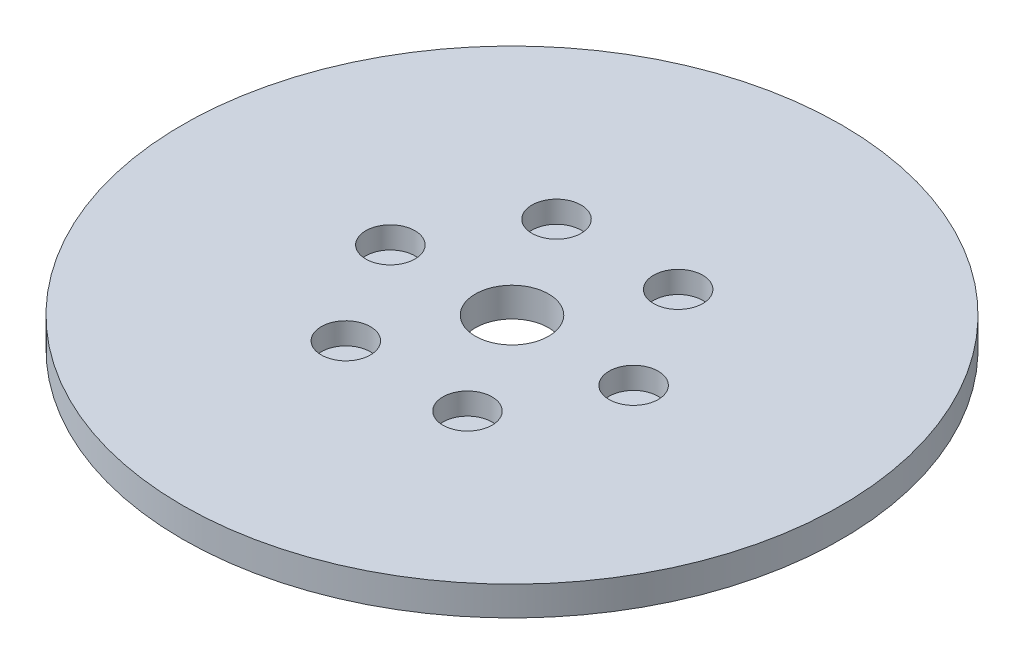
ISO-10303-21;
HEADER;
FILE_DESCRIPTION(('STEP AP214'),'2;1');
FILE_NAME('part.step','',(''),(''),'','','');
FILE_SCHEMA(('AUTOMOTIVE_DESIGN { 1 0 10303 214 1 1 1 1 }'));
ENDSEC;
DATA;
#1=APPLICATION_CONTEXT('core data for automotive mechanical design processes');
#2=APPLICATION_PROTOCOL_DEFINITION('international standard','automotive_design',2000,#1);
#3=PRODUCT_CONTEXT('',#1,'mechanical');
#4=PRODUCT('Part','Part','',(#3));
#5=PRODUCT_RELATED_PRODUCT_CATEGORY('part','',(#4));
#6=PRODUCT_DEFINITION_FORMATION('','',#4);
#7=PRODUCT_DEFINITION_CONTEXT('part definition',#1,'design');
#8=PRODUCT_DEFINITION('design','',#6,#7);
#9=PRODUCT_DEFINITION_SHAPE('','',#8);
#10=(LENGTH_UNIT() NAMED_UNIT(*) SI_UNIT(.MILLI.,.METRE.));
#11=(NAMED_UNIT(*) PLANE_ANGLE_UNIT() SI_UNIT($,.RADIAN.));
#12=(NAMED_UNIT(*) SI_UNIT($,.STERADIAN.) SOLID_ANGLE_UNIT());
#13=UNCERTAINTY_MEASURE_WITH_UNIT(LENGTH_MEASURE(1.E-05),#10,'distance_accuracy_value','');
#14=(GEOMETRIC_REPRESENTATION_CONTEXT(3) GLOBAL_UNCERTAINTY_ASSIGNED_CONTEXT((#13)) GLOBAL_UNIT_ASSIGNED_CONTEXT((#10,
#11,#12)) REPRESENTATION_CONTEXT('',''));
#15=CARTESIAN_POINT('',(0.,0.,0.));
#16=DIRECTION('',(0.,0.,1.));
#17=DIRECTION('',(1.,0.,0.));
#18=AXIS2_PLACEMENT_3D('',#15,#16,#17);
#19=CARTESIAN_POINT('',(0.,8.,0.));
#20=DIRECTION('',(0.,-1.,0.));
#21=DIRECTION('',(0.,0.,-1.));
#22=AXIS2_PLACEMENT_3D('',#19,#20,#21);
#23=CYLINDRICAL_SURFACE('',#22,90.);
#24=CARTESIAN_POINT('',(0.,8.,0.));
#25=DIRECTION('',(0.,1.,0.));
#26=DIRECTION('',(0.,0.,1.));
#27=AXIS2_PLACEMENT_3D('',#24,#25,#26);
#28=CIRCLE('',#27,90.);
#29=CARTESIAN_POINT('',(0.,8.,90.));
#30=VERTEX_POINT('',#29);
#31=EDGE_CURVE('E10',#30,#30,#28,.T.);
#32=ORIENTED_EDGE('',*,*,#31,.F.);
#33=EDGE_LOOP('',(#32));
#34=FACE_BOUND('',#33,.T.);
#35=CARTESIAN_POINT('',(0.,0.,0.));
#36=DIRECTION('',(0.,1.,0.));
#37=DIRECTION('',(0.,0.,1.));
#38=AXIS2_PLACEMENT_3D('',#35,#36,#37);
#39=CIRCLE('',#38,90.);
#40=CARTESIAN_POINT('',(0.,0.,90.));
#41=VERTEX_POINT('',#40);
#42=EDGE_CURVE('E37',#41,#41,#39,.T.);
#43=ORIENTED_EDGE('',*,*,#42,.T.);
#44=EDGE_LOOP('',(#43));
#45=FACE_BOUND('',#44,.T.);
#46=ADVANCED_FACE('F40',(#34,#45),#23,.T.);
#47=CARTESIAN_POINT('',(0.,8.,0.));
#48=DIRECTION('',(0.,1.,0.));
#49=DIRECTION('',(0.,0.,1.));
#50=AXIS2_PLACEMENT_3D('',#47,#48,#49);
#51=PLANE('',#50);
#52=CARTESIAN_POINT('',(-16.608898167708,8.,-28.7674554842071));
#53=DIRECTION('',(0.,1.,0.));
#54=DIRECTION('',(-0.866025403784433,0.,0.50000000000001));
#55=AXIS2_PLACEMENT_3D('',#52,#53,#54);
#56=CIRCLE('',#55,6.7142746204076);
#57=CARTESIAN_POINT('',(-22.423630556966,8.,-25.4103181740032));
#58=VERTEX_POINT('',#57);
#59=EDGE_CURVE('E70',#58,#58,#56,.T.);
#60=ORIENTED_EDGE('',*,*,#59,.F.);
#61=EDGE_LOOP('',(#60));
#62=FACE_BOUND('',#61,.T.);
#63=CARTESIAN_POINT('',(16.6088981677074,8.,-28.7674554842074));
#64=DIRECTION('',(0.,1.,0.));
#65=DIRECTION('',(-0.866025403784443,0.,-0.499999999999992));
#66=AXIS2_PLACEMENT_3D('',#63,#64,#65);
#67=CIRCLE('',#66,6.7142746204076);
#68=CARTESIAN_POINT('',(10.7941657784492,8.,-32.1245927944112));
#69=VERTEX_POINT('',#68);
#70=EDGE_CURVE('E71',#69,#69,#67,.T.);
#71=ORIENTED_EDGE('',*,*,#70,.F.);
#72=EDGE_LOOP('',(#71));
#73=FACE_BOUND('',#72,.T.);
#74=CARTESIAN_POINT('',(33.2177963354153,8.,0.));
#75=DIRECTION('',(0.,1.,0.));
#76=DIRECTION('',(0.,0.,-1.));
#77=AXIS2_PLACEMENT_3D('',#74,#75,#76);
#78=CIRCLE('',#77,6.7142746204076);
#79=CARTESIAN_POINT('',(33.2177963354153,8.,-6.7142746204076));
#80=VERTEX_POINT('',#79);
#81=EDGE_CURVE('E78',#80,#80,#78,.T.);
#82=ORIENTED_EDGE('',*,*,#81,.F.);
#83=EDGE_LOOP('',(#82));
#84=FACE_BOUND('',#83,.T.);
#85=CARTESIAN_POINT('',(16.6088981677078,8.,28.7674554842072));
#86=DIRECTION('',(0.,1.,0.));
#87=DIRECTION('',(0.866025403784436,0.,-0.500000000000004));
#88=AXIS2_PLACEMENT_3D('',#85,#86,#87);
#89=CIRCLE('',#88,6.7142746204076);
#90=CARTESIAN_POINT('',(22.4236305569659,8.,25.4103181740034));
#91=VERTEX_POINT('',#90);
#92=EDGE_CURVE('E84',#91,#91,#89,.T.);
#93=ORIENTED_EDGE('',*,*,#92,.F.);
#94=EDGE_LOOP('',(#93));
#95=FACE_BOUND('',#94,.T.);
#96=CARTESIAN_POINT('',(-16.6088981677076,8.,28.7674554842073));
#97=DIRECTION('',(0.,1.,0.));
#98=DIRECTION('',(0.86602540378444,0.,0.499999999999998));
#99=AXIS2_PLACEMENT_3D('',#96,#97,#98);
#100=CIRCLE('',#99,6.7142746204076);
#101=CARTESIAN_POINT('',(-10.7941657784495,8.,32.1245927944111));
#102=VERTEX_POINT('',#101);
#103=EDGE_CURVE('E61',#102,#102,#100,.T.);
#104=ORIENTED_EDGE('',*,*,#103,.F.);
#105=EDGE_LOOP('',(#104));
#106=FACE_BOUND('',#105,.T.);
#107=CARTESIAN_POINT('',(-33.2177963354153,8.,0.));
#108=DIRECTION('',(0.,1.,0.));
#109=DIRECTION('',(0.,0.,1.));
#110=AXIS2_PLACEMENT_3D('',#107,#108,#109);
#111=CIRCLE('',#110,6.7142746204076);
#112=CARTESIAN_POINT('',(-33.2177963354153,8.,6.7142746204076));
#113=VERTEX_POINT('',#112);
#114=EDGE_CURVE('E54',#113,#113,#111,.T.);
#115=ORIENTED_EDGE('',*,*,#114,.F.);
#116=EDGE_LOOP('',(#115));
#117=FACE_BOUND('',#116,.T.);
#118=CARTESIAN_POINT('',(0.,8.,0.));
#119=DIRECTION('',(0.,1.,0.));
#120=DIRECTION('',(0.,0.,1.));
#121=AXIS2_PLACEMENT_3D('',#118,#119,#120);
#122=CIRCLE('',#121,10.);
#123=CARTESIAN_POINT('',(0.,8.,10.));
#124=VERTEX_POINT('',#123);
#125=EDGE_CURVE('E50',#124,#124,#122,.T.);
#126=ORIENTED_EDGE('',*,*,#125,.F.);
#127=EDGE_LOOP('',(#126));
#128=FACE_BOUND('',#127,.T.);
#129=ORIENTED_EDGE('',*,*,#31,.T.);
#130=EDGE_LOOP('',(#129));
#131=FACE_BOUND('',#130,.T.);
#132=ADVANCED_FACE('F99',(#62,#73,#84,#95,#106,#117,#128,#131),#51,.T.);
#133=CARTESIAN_POINT('',(0.,0.,0.));
#134=DIRECTION('',(0.,1.,0.));
#135=DIRECTION('',(0.,0.,1.));
#136=AXIS2_PLACEMENT_3D('',#133,#134,#135);
#137=PLANE('',#136);
#138=CARTESIAN_POINT('',(0.,0.,0.));
#139=DIRECTION('',(0.,1.,0.));
#140=DIRECTION('',(0.,0.,1.));
#141=AXIS2_PLACEMENT_3D('',#138,#139,#140);
#142=CIRCLE('',#141,10.);
#143=CARTESIAN_POINT('',(0.,0.,10.));
#144=VERTEX_POINT('',#143);
#145=EDGE_CURVE('E47',#144,#144,#142,.T.);
#146=ORIENTED_EDGE('',*,*,#145,.T.);
#147=EDGE_LOOP('',(#146));
#148=FACE_BOUND('',#147,.T.);
#149=ORIENTED_EDGE('',*,*,#42,.F.);
#150=EDGE_LOOP('',(#149));
#151=FACE_BOUND('',#150,.T.);
#152=ADVANCED_FACE('F103',(#148,#151),#137,.F.);
#153=CARTESIAN_POINT('',(0.,8.,0.));
#154=DIRECTION('',(0.,-1.,0.));
#155=DIRECTION('',(0.,0.,-1.));
#156=AXIS2_PLACEMENT_3D('',#153,#154,#155);
#157=CYLINDRICAL_SURFACE('',#156,10.);
#158=ORIENTED_EDGE('',*,*,#125,.T.);
#159=EDGE_LOOP('',(#158));
#160=FACE_BOUND('',#159,.T.);
#161=ORIENTED_EDGE('',*,*,#145,.F.);
#162=EDGE_LOOP('',(#161));
#163=FACE_BOUND('',#162,.T.);
#164=ADVANCED_FACE('F115',(#160,#163),#157,.F.);
#165=CARTESIAN_POINT('',(-33.2177963354153,2.04279905783907,0.));
#166=DIRECTION('',(0.,1.,0.));
#167=DIRECTION('',(0.,0.,1.));
#168=AXIS2_PLACEMENT_3D('',#165,#166,#167);
#169=CYLINDRICAL_SURFACE('',#168,6.7142746204076);
#170=CARTESIAN_POINT('',(-33.2177963354153,2.04279905783907,0.));
#171=DIRECTION('',(0.,1.,0.));
#172=DIRECTION('',(0.,0.,1.));
#173=AXIS2_PLACEMENT_3D('',#170,#171,#172);
#174=CIRCLE('',#173,6.7142746204076);
#175=CARTESIAN_POINT('',(-33.2177963354153,2.04279905783907,6.7142746204076));
#176=VERTEX_POINT('',#175);
#177=EDGE_CURVE('E55',#176,#176,#174,.T.);
#178=ORIENTED_EDGE('',*,*,#177,.F.);
#179=EDGE_LOOP('',(#178));
#180=FACE_BOUND('',#179,.T.);
#181=ORIENTED_EDGE('',*,*,#114,.T.);
#182=EDGE_LOOP('',(#181));
#183=FACE_BOUND('',#182,.T.);
#184=ADVANCED_FACE('F113',(#180,#183),#169,.F.);
#185=CARTESIAN_POINT('',(-33.2177963354153,2.04279905783907,0.));
#186=DIRECTION('',(0.,1.,0.));
#187=DIRECTION('',(0.,0.,1.));
#188=AXIS2_PLACEMENT_3D('',#185,#186,#187);
#189=PLANE('',#188);
#190=ORIENTED_EDGE('',*,*,#177,.T.);
#191=EDGE_LOOP('',(#190));
#192=FACE_BOUND('',#191,.T.);
#193=ADVANCED_FACE('F144',(#192),#189,.T.);
#194=CARTESIAN_POINT('',(-16.6088981677076,2.04279905783907,28.7674554842073));
#195=DIRECTION('',(0.,1.,0.));
#196=DIRECTION('',(0.,0.,1.));
#197=AXIS2_PLACEMENT_3D('',#194,#195,#196);
#198=CYLINDRICAL_SURFACE('',#197,6.7142746204076);
#199=CARTESIAN_POINT('',(-16.6088981677076,2.04279905783907,28.7674554842073));
#200=DIRECTION('',(0.,1.,0.));
#201=DIRECTION('',(0.86602540378444,0.,0.499999999999998));
#202=AXIS2_PLACEMENT_3D('',#199,#200,#201);
#203=CIRCLE('',#202,6.7142746204076);
#204=CARTESIAN_POINT('',(-10.7941657784495,2.04279905783907,32.1245927944111));
#205=VERTEX_POINT('',#204);
#206=EDGE_CURVE('E59',#205,#205,#203,.T.);
#207=ORIENTED_EDGE('',*,*,#206,.F.);
#208=EDGE_LOOP('',(#207));
#209=FACE_BOUND('',#208,.T.);
#210=ORIENTED_EDGE('',*,*,#103,.T.);
#211=EDGE_LOOP('',(#210));
#212=FACE_BOUND('',#211,.T.);
#213=ADVANCED_FACE('F153',(#209,#212),#198,.F.);
#214=CARTESIAN_POINT('',(-16.6088981677076,2.04279905783907,28.7674554842073));
#215=DIRECTION('',(0.,1.,0.));
#216=DIRECTION('',(0.86602540378444,0.,0.499999999999998));
#217=AXIS2_PLACEMENT_3D('',#214,#215,#216);
#218=PLANE('',#217);
#219=ORIENTED_EDGE('',*,*,#206,.T.);
#220=EDGE_LOOP('',(#219));
#221=FACE_BOUND('',#220,.T.);
#222=ADVANCED_FACE('F96',(#221),#218,.T.);
#223=CARTESIAN_POINT('',(16.6088981677078,2.04279905783907,28.7674554842072));
#224=DIRECTION('',(0.,1.,0.));
#225=DIRECTION('',(0.,0.,1.));
#226=AXIS2_PLACEMENT_3D('',#223,#224,#225);
#227=CYLINDRICAL_SURFACE('',#226,6.7142746204076);
#228=CARTESIAN_POINT('',(16.6088981677078,2.04279905783907,28.7674554842072));
#229=DIRECTION('',(0.,1.,0.));
#230=DIRECTION('',(0.866025403784436,0.,-0.500000000000004));
#231=AXIS2_PLACEMENT_3D('',#228,#229,#230);
#232=CIRCLE('',#231,6.7142746204076);
#233=CARTESIAN_POINT('',(22.4236305569659,2.04279905783907,25.4103181740034));
#234=VERTEX_POINT('',#233);
#235=EDGE_CURVE('E63',#234,#234,#232,.T.);
#236=ORIENTED_EDGE('',*,*,#235,.F.);
#237=EDGE_LOOP('',(#236));
#238=FACE_BOUND('',#237,.T.);
#239=ORIENTED_EDGE('',*,*,#92,.T.);
#240=EDGE_LOOP('',(#239));
#241=FACE_BOUND('',#240,.T.);
#242=ADVANCED_FACE('F91',(#238,#241),#227,.F.);
#243=CARTESIAN_POINT('',(16.6088981677078,2.04279905783907,28.7674554842072));
#244=DIRECTION('',(0.,1.,0.));
#245=DIRECTION('',(0.866025403784436,0.,-0.500000000000004));
#246=AXIS2_PLACEMENT_3D('',#243,#244,#245);
#247=PLANE('',#246);
#248=ORIENTED_EDGE('',*,*,#235,.T.);
#249=EDGE_LOOP('',(#248));
#250=FACE_BOUND('',#249,.T.);
#251=ADVANCED_FACE('F93',(#250),#247,.T.);
#252=CARTESIAN_POINT('',(33.2177963354153,2.04279905783907,0.));
#253=DIRECTION('',(0.,1.,0.));
#254=DIRECTION('',(0.,0.,1.));
#255=AXIS2_PLACEMENT_3D('',#252,#253,#254);
#256=CYLINDRICAL_SURFACE('',#255,6.7142746204076);
#257=CARTESIAN_POINT('',(33.2177963354153,2.04279905783907,0.));
#258=DIRECTION('',(0.,1.,0.));
#259=DIRECTION('',(0.,0.,-1.));
#260=AXIS2_PLACEMENT_3D('',#257,#258,#259);
#261=CIRCLE('',#260,6.7142746204076);
#262=CARTESIAN_POINT('',(33.2177963354153,2.04279905783907,-6.7142746204076));
#263=VERTEX_POINT('',#262);
#264=EDGE_CURVE('E85',#263,#263,#261,.T.);
#265=ORIENTED_EDGE('',*,*,#264,.F.);
#266=EDGE_LOOP('',(#265));
#267=FACE_BOUND('',#266,.T.);
#268=ORIENTED_EDGE('',*,*,#81,.T.);
#269=EDGE_LOOP('',(#268));
#270=FACE_BOUND('',#269,.T.);
#271=ADVANCED_FACE('F187',(#267,#270),#256,.F.);
#272=CARTESIAN_POINT('',(33.2177963354153,2.04279905783907,0.));
#273=DIRECTION('',(0.,1.,0.));
#274=DIRECTION('',(0.,0.,-1.));
#275=AXIS2_PLACEMENT_3D('',#272,#273,#274);
#276=PLANE('',#275);
#277=ORIENTED_EDGE('',*,*,#264,.T.);
#278=EDGE_LOOP('',(#277));
#279=FACE_BOUND('',#278,.T.);
#280=ADVANCED_FACE('F198',(#279),#276,.T.);
#281=CARTESIAN_POINT('',(16.6088981677074,2.04279905783907,-28.7674554842074));
#282=DIRECTION('',(0.,1.,0.));
#283=DIRECTION('',(0.,0.,1.));
#284=AXIS2_PLACEMENT_3D('',#281,#282,#283);
#285=CYLINDRICAL_SURFACE('',#284,6.7142746204076);
#286=CARTESIAN_POINT('',(16.6088981677074,2.04279905783907,-28.7674554842074));
#287=DIRECTION('',(0.,1.,0.));
#288=DIRECTION('',(-0.866025403784443,0.,-0.499999999999992));
#289=AXIS2_PLACEMENT_3D('',#286,#287,#288);
#290=CIRCLE('',#289,6.7142746204076);
#291=CARTESIAN_POINT('',(10.7941657784492,2.04279905783907,-32.1245927944112));
#292=VERTEX_POINT('',#291);
#293=EDGE_CURVE('E76',#292,#292,#290,.T.);
#294=ORIENTED_EDGE('',*,*,#293,.F.);
#295=EDGE_LOOP('',(#294));
#296=FACE_BOUND('',#295,.T.);
#297=ORIENTED_EDGE('',*,*,#70,.T.);
#298=EDGE_LOOP('',(#297));
#299=FACE_BOUND('',#298,.T.);
#300=ADVANCED_FACE('F202',(#296,#299),#285,.F.);
#301=CARTESIAN_POINT('',(16.6088981677074,2.04279905783907,-28.7674554842074));
#302=DIRECTION('',(0.,1.,0.));
#303=DIRECTION('',(-0.866025403784443,0.,-0.499999999999992));
#304=AXIS2_PLACEMENT_3D('',#301,#302,#303);
#305=PLANE('',#304);
#306=ORIENTED_EDGE('',*,*,#293,.T.);
#307=EDGE_LOOP('',(#306));
#308=FACE_BOUND('',#307,.T.);
#309=ADVANCED_FACE('F212',(#308),#305,.T.);
#310=CARTESIAN_POINT('',(-16.608898167708,2.04279905783907,-28.7674554842071));
#311=DIRECTION('',(0.,1.,0.));
#312=DIRECTION('',(0.,0.,1.));
#313=AXIS2_PLACEMENT_3D('',#310,#311,#312);
#314=CYLINDRICAL_SURFACE('',#313,6.7142746204076);
#315=CARTESIAN_POINT('',(-16.608898167708,2.04279905783907,-28.7674554842071));
#316=DIRECTION('',(0.,1.,0.));
#317=DIRECTION('',(-0.866025403784433,0.,0.50000000000001));
#318=AXIS2_PLACEMENT_3D('',#315,#316,#317);
#319=CIRCLE('',#318,6.7142746204076);
#320=CARTESIAN_POINT('',(-22.423630556966,2.04279905783907,-25.4103181740032));
#321=VERTEX_POINT('',#320);
#322=EDGE_CURVE('E69',#321,#321,#319,.T.);
#323=ORIENTED_EDGE('',*,*,#322,.F.);
#324=EDGE_LOOP('',(#323));
#325=FACE_BOUND('',#324,.T.);
#326=ORIENTED_EDGE('',*,*,#59,.T.);
#327=EDGE_LOOP('',(#326));
#328=FACE_BOUND('',#327,.T.);
#329=ADVANCED_FACE('F224',(#325,#328),#314,.F.);
#330=CARTESIAN_POINT('',(-16.608898167708,2.04279905783907,-28.7674554842071));
#331=DIRECTION('',(0.,1.,0.));
#332=DIRECTION('',(-0.866025403784433,0.,0.50000000000001));
#333=AXIS2_PLACEMENT_3D('',#330,#331,#332);
#334=PLANE('',#333);
#335=ORIENTED_EDGE('',*,*,#322,.T.);
#336=EDGE_LOOP('',(#335));
#337=FACE_BOUND('',#336,.T.);
#338=ADVANCED_FACE('F235',(#337),#334,.T.);
#339=CLOSED_SHELL('',(#46,#132,#152,#164,#184,#193,#213,#222,#242,#251,#271,#280,#300,#309,#329,#338));
#340=MANIFOLD_SOLID_BREP('B2',#339);
#341=ADVANCED_BREP_SHAPE_REPRESENTATION('',(#18,#340),#14);
#342=SHAPE_DEFINITION_REPRESENTATION(#9,#341);
ENDSEC;
END-ISO-10303-21;
